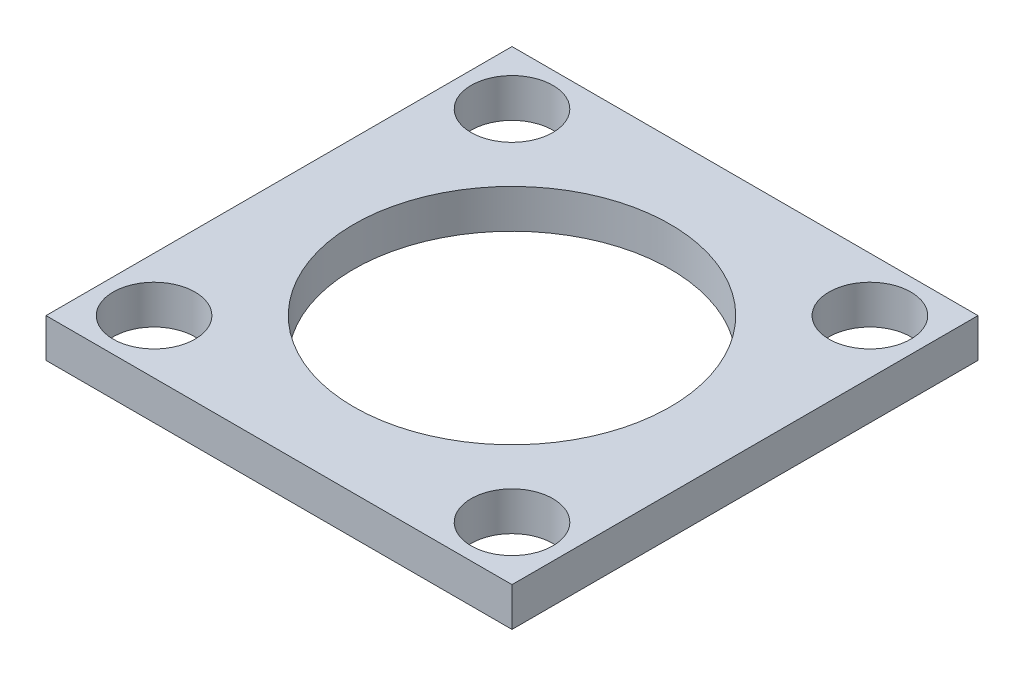
ISO-10303-21;
HEADER;
FILE_DESCRIPTION(('STEP AP214'),'2;1');
FILE_NAME('part.step','',(''),(''),'','','');
FILE_SCHEMA(('AUTOMOTIVE_DESIGN { 1 0 10303 214 1 1 1 1 }'));
ENDSEC;
DATA;
#1=APPLICATION_CONTEXT('core data for automotive mechanical design processes');
#2=APPLICATION_PROTOCOL_DEFINITION('international standard','automotive_design',2000,#1);
#3=PRODUCT_CONTEXT('',#1,'mechanical');
#4=PRODUCT('Part','Part','',(#3));
#5=PRODUCT_RELATED_PRODUCT_CATEGORY('part','',(#4));
#6=PRODUCT_DEFINITION_FORMATION('','',#4);
#7=PRODUCT_DEFINITION_CONTEXT('part definition',#1,'design');
#8=PRODUCT_DEFINITION('design','',#6,#7);
#9=PRODUCT_DEFINITION_SHAPE('','',#8);
#10=(LENGTH_UNIT() NAMED_UNIT(*) SI_UNIT(.MILLI.,.METRE.));
#11=(NAMED_UNIT(*) PLANE_ANGLE_UNIT() SI_UNIT($,.RADIAN.));
#12=(NAMED_UNIT(*) SI_UNIT($,.STERADIAN.) SOLID_ANGLE_UNIT());
#13=UNCERTAINTY_MEASURE_WITH_UNIT(LENGTH_MEASURE(1.E-05),#10,'distance_accuracy_value','');
#14=(GEOMETRIC_REPRESENTATION_CONTEXT(3) GLOBAL_UNCERTAINTY_ASSIGNED_CONTEXT((#13)) GLOBAL_UNIT_ASSIGNED_CONTEXT((#10,
#11,#12)) REPRESENTATION_CONTEXT('',''));
#15=CARTESIAN_POINT('',(0.,0.,0.));
#16=DIRECTION('',(0.,0.,1.));
#17=DIRECTION('',(1.,0.,0.));
#18=AXIS2_PLACEMENT_3D('',#15,#16,#17);
#19=CARTESIAN_POINT('',(0.,0.5,0.));
#20=DIRECTION('',(1.,0.,0.));
#21=DIRECTION('',(0.,0.,-1.));
#22=AXIS2_PLACEMENT_3D('',#19,#20,#21);
#23=PLANE('',#22);
#24=DIRECTION('',(0.,0.,1.));
#25=VECTOR('',#24,1.);
#26=CARTESIAN_POINT('',(0.,0.,0.));
#27=LINE('',#26,#25);
#28=CARTESIAN_POINT('',(0.,0.,-6.00000000000001));
#29=VERTEX_POINT('',#28);
#30=CARTESIAN_POINT('',(0.,0.,0.));
#31=VERTEX_POINT('',#30);
#32=EDGE_CURVE('E74',#29,#31,#27,.T.);
#33=ORIENTED_EDGE('',*,*,#32,.T.);
#34=DIRECTION('',(0.,-1.,0.));
#35=VECTOR('',#34,1.);
#36=CARTESIAN_POINT('',(0.,0.5,0.));
#37=LINE('',#36,#35);
#38=CARTESIAN_POINT('',(0.,0.5,0.));
#39=VERTEX_POINT('',#38);
#40=EDGE_CURVE('E11',#39,#31,#37,.T.);
#41=ORIENTED_EDGE('',*,*,#40,.F.);
#42=DIRECTION('',(0.,0.,1.));
#43=VECTOR('',#42,1.);
#44=CARTESIAN_POINT('',(0.,0.5,0.));
#45=LINE('',#44,#43);
#46=CARTESIAN_POINT('',(0.,0.5,-6.00000000000001));
#47=VERTEX_POINT('',#46);
#48=EDGE_CURVE('E97',#47,#39,#45,.T.);
#49=ORIENTED_EDGE('',*,*,#48,.F.);
#50=DIRECTION('',(0.,-1.,0.));
#51=VECTOR('',#50,1.);
#52=CARTESIAN_POINT('',(0.,0.5,-6.00000000000001));
#53=LINE('',#52,#51);
#54=EDGE_CURVE('E86',#47,#29,#53,.T.);
#55=ORIENTED_EDGE('',*,*,#54,.T.);
#56=EDGE_LOOP('',(#33,#41,#49,#55));
#57=FACE_BOUND('',#56,.T.);
#58=ADVANCED_FACE('F30',(#57),#23,.F.);
#59=CARTESIAN_POINT('',(0.,0.5,0.));
#60=DIRECTION('',(0.,0.,-1.));
#61=DIRECTION('',(-1.,0.,0.));
#62=AXIS2_PLACEMENT_3D('',#59,#60,#61);
#63=PLANE('',#62);
#64=DIRECTION('',(1.,0.,0.));
#65=VECTOR('',#64,1.);
#66=CARTESIAN_POINT('',(0.,0.,0.));
#67=LINE('',#66,#65);
#68=CARTESIAN_POINT('',(6.,0.,0.));
#69=VERTEX_POINT('',#68);
#70=EDGE_CURVE('E70',#31,#69,#67,.T.);
#71=ORIENTED_EDGE('',*,*,#70,.T.);
#72=DIRECTION('',(0.,-1.,0.));
#73=VECTOR('',#72,1.);
#74=CARTESIAN_POINT('',(6.,0.5,0.));
#75=LINE('',#74,#73);
#76=CARTESIAN_POINT('',(6.,0.5,0.));
#77=VERTEX_POINT('',#76);
#78=EDGE_CURVE('E37',#77,#69,#75,.T.);
#79=ORIENTED_EDGE('',*,*,#78,.F.);
#80=DIRECTION('',(1.,0.,0.));
#81=VECTOR('',#80,1.);
#82=CARTESIAN_POINT('',(0.,0.5,0.));
#83=LINE('',#82,#81);
#84=EDGE_CURVE('E82',#39,#77,#83,.T.);
#85=ORIENTED_EDGE('',*,*,#84,.F.);
#86=ORIENTED_EDGE('',*,*,#40,.T.);
#87=EDGE_LOOP('',(#71,#79,#85,#86));
#88=FACE_BOUND('',#87,.T.);
#89=ADVANCED_FACE('F81',(#88),#63,.F.);
#90=CARTESIAN_POINT('',(6.,0.5,0.));
#91=DIRECTION('',(-1.,0.,0.));
#92=DIRECTION('',(0.,0.,1.));
#93=AXIS2_PLACEMENT_3D('',#90,#91,#92);
#94=PLANE('',#93);
#95=DIRECTION('',(0.,0.,-1.));
#96=VECTOR('',#95,1.);
#97=CARTESIAN_POINT('',(6.,0.,0.));
#98=LINE('',#97,#96);
#99=CARTESIAN_POINT('',(6.,0.,-6.));
#100=VERTEX_POINT('',#99);
#101=EDGE_CURVE('E75',#69,#100,#98,.T.);
#102=ORIENTED_EDGE('',*,*,#101,.T.);
#103=DIRECTION('',(0.,-1.,0.));
#104=VECTOR('',#103,1.);
#105=CARTESIAN_POINT('',(6.,0.5,-6.));
#106=LINE('',#105,#104);
#107=CARTESIAN_POINT('',(6.,0.5,-6.));
#108=VERTEX_POINT('',#107);
#109=EDGE_CURVE('E103',#108,#100,#106,.T.);
#110=ORIENTED_EDGE('',*,*,#109,.F.);
#111=DIRECTION('',(0.,0.,-1.));
#112=VECTOR('',#111,1.);
#113=CARTESIAN_POINT('',(6.,0.5,0.));
#114=LINE('',#113,#112);
#115=EDGE_CURVE('E49',#77,#108,#114,.T.);
#116=ORIENTED_EDGE('',*,*,#115,.F.);
#117=ORIENTED_EDGE('',*,*,#78,.T.);
#118=EDGE_LOOP('',(#102,#110,#116,#117));
#119=FACE_BOUND('',#118,.T.);
#120=ADVANCED_FACE('F106',(#119),#94,.F.);
#121=CARTESIAN_POINT('',(0.,0.5,-6.00000000000001));
#122=DIRECTION('',(0.,0.,1.));
#123=DIRECTION('',(1.,0.,0.));
#124=AXIS2_PLACEMENT_3D('',#121,#122,#123);
#125=PLANE('',#124);
#126=DIRECTION('',(-1.,0.,0.));
#127=VECTOR('',#126,1.);
#128=CARTESIAN_POINT('',(0.,0.,-6.00000000000001));
#129=LINE('',#128,#127);
#130=EDGE_CURVE('E95',#100,#29,#129,.T.);
#131=ORIENTED_EDGE('',*,*,#130,.T.);
#132=ORIENTED_EDGE('',*,*,#54,.F.);
#133=DIRECTION('',(-1.,0.,0.));
#134=VECTOR('',#133,1.);
#135=CARTESIAN_POINT('',(0.,0.5,-6.00000000000001));
#136=LINE('',#135,#134);
#137=EDGE_CURVE('E44',#108,#47,#136,.T.);
#138=ORIENTED_EDGE('',*,*,#137,.F.);
#139=ORIENTED_EDGE('',*,*,#109,.T.);
#140=EDGE_LOOP('',(#131,#132,#138,#139));
#141=FACE_BOUND('',#140,.T.);
#142=ADVANCED_FACE('F108',(#141),#125,.F.);
#143=CARTESIAN_POINT('',(0.,0.5,0.));
#144=DIRECTION('',(0.,-1.,0.));
#145=DIRECTION('',(0.,0.,-1.));
#146=AXIS2_PLACEMENT_3D('',#143,#144,#145);
#147=PLANE('',#146);
#148=CARTESIAN_POINT('',(0.695868945868939,0.5,-0.695868945868939));
#149=DIRECTION('',(0.,1.,0.));
#150=DIRECTION('',(0.,0.,1.));
#151=AXIS2_PLACEMENT_3D('',#148,#149,#150);
#152=CIRCLE('',#151,0.526608140648827);
#153=CARTESIAN_POINT('',(0.695868945868939,0.5,-0.169260805220112));
#154=VERTEX_POINT('',#153);
#155=EDGE_CURVE('E205',#154,#154,#152,.T.);
#156=ORIENTED_EDGE('',*,*,#155,.F.);
#157=EDGE_LOOP('',(#156));
#158=FACE_BOUND('',#157,.T.);
#159=CARTESIAN_POINT('',(5.30413105413106,0.5,-0.695868945868938));
#160=DIRECTION('',(0.,1.,0.));
#161=DIRECTION('',(0.,0.,1.));
#162=AXIS2_PLACEMENT_3D('',#159,#160,#161);
#163=CIRCLE('',#162,0.526608140648827);
#164=CARTESIAN_POINT('',(5.30413105413106,0.5,-0.169260805220111));
#165=VERTEX_POINT('',#164);
#166=EDGE_CURVE('E207',#165,#165,#163,.T.);
#167=ORIENTED_EDGE('',*,*,#166,.F.);
#168=EDGE_LOOP('',(#167));
#169=FACE_BOUND('',#168,.T.);
#170=CARTESIAN_POINT('',(5.30413105413106,0.5,-5.30413105413106));
#171=DIRECTION('',(0.,1.,0.));
#172=DIRECTION('',(0.,0.,1.));
#173=AXIS2_PLACEMENT_3D('',#170,#171,#172);
#174=CIRCLE('',#173,0.526608140648827);
#175=CARTESIAN_POINT('',(5.30413105413106,0.5,-4.77752291348223));
#176=VERTEX_POINT('',#175);
#177=EDGE_CURVE('E215',#176,#176,#174,.T.);
#178=ORIENTED_EDGE('',*,*,#177,.F.);
#179=EDGE_LOOP('',(#178));
#180=FACE_BOUND('',#179,.T.);
#181=CARTESIAN_POINT('',(0.695868945868944,0.5,-5.30413105413106));
#182=DIRECTION('',(0.,1.,0.));
#183=DIRECTION('',(0.,0.,1.));
#184=AXIS2_PLACEMENT_3D('',#181,#182,#183);
#185=CIRCLE('',#184,0.526608140648827);
#186=CARTESIAN_POINT('',(0.695868945868944,0.5,-4.77752291348223));
#187=VERTEX_POINT('',#186);
#188=EDGE_CURVE('E221',#187,#187,#185,.T.);
#189=ORIENTED_EDGE('',*,*,#188,.F.);
#190=EDGE_LOOP('',(#189));
#191=FACE_BOUND('',#190,.T.);
#192=CARTESIAN_POINT('',(3.,0.5,-3.));
#193=DIRECTION('',(0.,1.,0.));
#194=DIRECTION('',(0.,0.,1.));
#195=AXIS2_PLACEMENT_3D('',#192,#193,#194);
#196=CIRCLE('',#195,2.03709929576328);
#197=CARTESIAN_POINT('',(3.,0.5,-0.962900704236727));
#198=VERTEX_POINT('',#197);
#199=EDGE_CURVE('E90',#198,#198,#196,.T.);
#200=ORIENTED_EDGE('',*,*,#199,.F.);
#201=EDGE_LOOP('',(#200));
#202=FACE_BOUND('',#201,.T.);
#203=ORIENTED_EDGE('',*,*,#48,.T.);
#204=ORIENTED_EDGE('',*,*,#84,.T.);
#205=ORIENTED_EDGE('',*,*,#115,.T.);
#206=ORIENTED_EDGE('',*,*,#137,.T.);
#207=EDGE_LOOP('',(#203,#204,#205,#206));
#208=FACE_BOUND('',#207,.T.);
#209=ADVANCED_FACE('F109',(#158,#169,#180,#191,#202,#208),#147,.F.);
#210=CARTESIAN_POINT('',(0.,0.,0.));
#211=DIRECTION('',(0.,-1.,0.));
#212=DIRECTION('',(0.,0.,-1.));
#213=AXIS2_PLACEMENT_3D('',#210,#211,#212);
#214=PLANE('',#213);
#215=CARTESIAN_POINT('',(0.695868945868939,0.,-0.695868945868939));
#216=DIRECTION('',(0.,1.,0.));
#217=DIRECTION('',(0.,0.,1.));
#218=AXIS2_PLACEMENT_3D('',#215,#216,#217);
#219=CIRCLE('',#218,0.526608140648827);
#220=CARTESIAN_POINT('',(0.695868945868939,0.,-0.169260805220112));
#221=VERTEX_POINT('',#220);
#222=EDGE_CURVE('E203',#221,#221,#219,.T.);
#223=ORIENTED_EDGE('',*,*,#222,.T.);
#224=EDGE_LOOP('',(#223));
#225=FACE_BOUND('',#224,.T.);
#226=CARTESIAN_POINT('',(5.30413105413106,0.,-0.695868945868938));
#227=DIRECTION('',(0.,1.,0.));
#228=DIRECTION('',(0.,0.,1.));
#229=AXIS2_PLACEMENT_3D('',#226,#227,#228);
#230=CIRCLE('',#229,0.526608140648827);
#231=CARTESIAN_POINT('',(5.30413105413106,0.,-0.169260805220111));
#232=VERTEX_POINT('',#231);
#233=EDGE_CURVE('E212',#232,#232,#230,.T.);
#234=ORIENTED_EDGE('',*,*,#233,.T.);
#235=EDGE_LOOP('',(#234));
#236=FACE_BOUND('',#235,.T.);
#237=CARTESIAN_POINT('',(5.30413105413106,0.,-5.30413105413106));
#238=DIRECTION('',(0.,1.,0.));
#239=DIRECTION('',(0.,0.,1.));
#240=AXIS2_PLACEMENT_3D('',#237,#238,#239);
#241=CIRCLE('',#240,0.526608140648827);
#242=CARTESIAN_POINT('',(5.30413105413106,0.,-4.77752291348223));
#243=VERTEX_POINT('',#242);
#244=EDGE_CURVE('E218',#243,#243,#241,.T.);
#245=ORIENTED_EDGE('',*,*,#244,.T.);
#246=EDGE_LOOP('',(#245));
#247=FACE_BOUND('',#246,.T.);
#248=CARTESIAN_POINT('',(0.695868945868944,0.,-5.30413105413106));
#249=DIRECTION('',(0.,1.,0.));
#250=DIRECTION('',(0.,0.,1.));
#251=AXIS2_PLACEMENT_3D('',#248,#249,#250);
#252=CIRCLE('',#251,0.526608140648827);
#253=CARTESIAN_POINT('',(0.695868945868944,0.,-4.77752291348223));
#254=VERTEX_POINT('',#253);
#255=EDGE_CURVE('E224',#254,#254,#252,.T.);
#256=ORIENTED_EDGE('',*,*,#255,.T.);
#257=EDGE_LOOP('',(#256));
#258=FACE_BOUND('',#257,.T.);
#259=CARTESIAN_POINT('',(3.,0.,-3.));
#260=DIRECTION('',(0.,1.,0.));
#261=DIRECTION('',(0.,0.,1.));
#262=AXIS2_PLACEMENT_3D('',#259,#260,#261);
#263=CIRCLE('',#262,2.03709929576328);
#264=CARTESIAN_POINT('',(3.,0.,-0.962900704236727));
#265=VERTEX_POINT('',#264);
#266=EDGE_CURVE('E87',#265,#265,#263,.T.);
#267=ORIENTED_EDGE('',*,*,#266,.T.);
#268=EDGE_LOOP('',(#267));
#269=FACE_BOUND('',#268,.T.);
#270=ORIENTED_EDGE('',*,*,#32,.F.);
#271=ORIENTED_EDGE('',*,*,#130,.F.);
#272=ORIENTED_EDGE('',*,*,#101,.F.);
#273=ORIENTED_EDGE('',*,*,#70,.F.);
#274=EDGE_LOOP('',(#270,#271,#272,#273));
#275=FACE_BOUND('',#274,.T.);
#276=ADVANCED_FACE('F71',(#225,#236,#247,#258,#269,#275),#214,.T.);
#277=CARTESIAN_POINT('',(3.,0.,-3.));
#278=DIRECTION('',(0.,1.,0.));
#279=DIRECTION('',(0.,0.,1.));
#280=AXIS2_PLACEMENT_3D('',#277,#278,#279);
#281=CYLINDRICAL_SURFACE('',#280,2.03709929576328);
#282=ORIENTED_EDGE('',*,*,#266,.F.);
#283=EDGE_LOOP('',(#282));
#284=FACE_BOUND('',#283,.T.);
#285=ORIENTED_EDGE('',*,*,#199,.T.);
#286=EDGE_LOOP('',(#285));
#287=FACE_BOUND('',#286,.T.);
#288=ADVANCED_FACE('F117',(#284,#287),#281,.F.);
#289=CARTESIAN_POINT('',(0.695868945868944,0.,-5.30413105413106));
#290=DIRECTION('',(0.,1.,0.));
#291=DIRECTION('',(0.,0.,1.));
#292=AXIS2_PLACEMENT_3D('',#289,#290,#291);
#293=CYLINDRICAL_SURFACE('',#292,0.526608140648827);
#294=ORIENTED_EDGE('',*,*,#255,.F.);
#295=EDGE_LOOP('',(#294));
#296=FACE_BOUND('',#295,.T.);
#297=ORIENTED_EDGE('',*,*,#188,.T.);
#298=EDGE_LOOP('',(#297));
#299=FACE_BOUND('',#298,.T.);
#300=ADVANCED_FACE('F146',(#296,#299),#293,.F.);
#301=CARTESIAN_POINT('',(5.30413105413106,0.,-5.30413105413106));
#302=DIRECTION('',(0.,1.,0.));
#303=DIRECTION('',(0.,0.,1.));
#304=AXIS2_PLACEMENT_3D('',#301,#302,#303);
#305=CYLINDRICAL_SURFACE('',#304,0.526608140648827);
#306=ORIENTED_EDGE('',*,*,#244,.F.);
#307=EDGE_LOOP('',(#306));
#308=FACE_BOUND('',#307,.T.);
#309=ORIENTED_EDGE('',*,*,#177,.T.);
#310=EDGE_LOOP('',(#309));
#311=FACE_BOUND('',#310,.T.);
#312=ADVANCED_FACE('F166',(#308,#311),#305,.F.);
#313=CARTESIAN_POINT('',(5.30413105413106,0.,-0.695868945868938));
#314=DIRECTION('',(0.,1.,0.));
#315=DIRECTION('',(0.,0.,1.));
#316=AXIS2_PLACEMENT_3D('',#313,#314,#315);
#317=CYLINDRICAL_SURFACE('',#316,0.526608140648827);
#318=ORIENTED_EDGE('',*,*,#233,.F.);
#319=EDGE_LOOP('',(#318));
#320=FACE_BOUND('',#319,.T.);
#321=ORIENTED_EDGE('',*,*,#166,.T.);
#322=EDGE_LOOP('',(#321));
#323=FACE_BOUND('',#322,.T.);
#324=ADVANCED_FACE('F176',(#320,#323),#317,.F.);
#325=CARTESIAN_POINT('',(0.695868945868939,0.,-0.695868945868939));
#326=DIRECTION('',(0.,1.,0.));
#327=DIRECTION('',(0.,0.,1.));
#328=AXIS2_PLACEMENT_3D('',#325,#326,#327);
#329=CYLINDRICAL_SURFACE('',#328,0.526608140648827);
#330=ORIENTED_EDGE('',*,*,#222,.F.);
#331=EDGE_LOOP('',(#330));
#332=FACE_BOUND('',#331,.T.);
#333=ORIENTED_EDGE('',*,*,#155,.T.);
#334=EDGE_LOOP('',(#333));
#335=FACE_BOUND('',#334,.T.);
#336=ADVANCED_FACE('F186',(#332,#335),#329,.F.);
#337=CLOSED_SHELL('',(#58,#89,#120,#142,#209,#276,#288,#300,#312,#324,#336));
#338=MANIFOLD_SOLID_BREP('B2',#337);
#339=ADVANCED_BREP_SHAPE_REPRESENTATION('',(#18,#338),#14);
#340=SHAPE_DEFINITION_REPRESENTATION(#9,#339);
ENDSEC;
END-ISO-10303-21;
